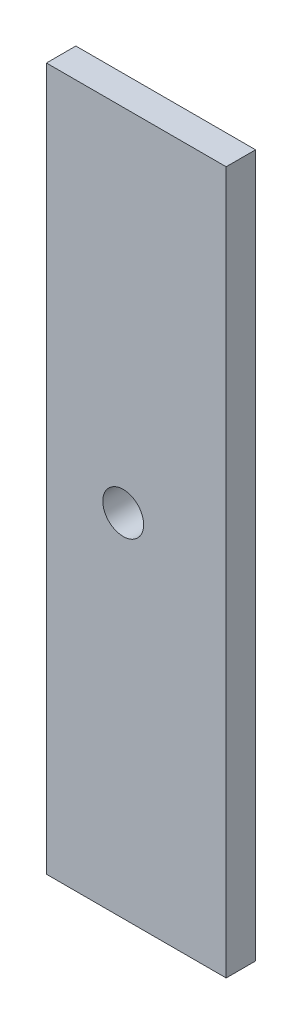
ISO-10303-21;
HEADER;
FILE_DESCRIPTION(('STEP AP214'),'2;1');
FILE_NAME('part.step','',(''),(''),'','','');
FILE_SCHEMA(('AUTOMOTIVE_DESIGN { 1 0 10303 214 1 1 1 1 }'));
ENDSEC;
DATA;
#1=APPLICATION_CONTEXT('core data for automotive mechanical design processes');
#2=APPLICATION_PROTOCOL_DEFINITION('international standard','automotive_design',2000,#1);
#3=PRODUCT_CONTEXT('',#1,'mechanical');
#4=PRODUCT('Part','Part','',(#3));
#5=PRODUCT_RELATED_PRODUCT_CATEGORY('part','',(#4));
#6=PRODUCT_DEFINITION_FORMATION('','',#4);
#7=PRODUCT_DEFINITION_CONTEXT('part definition',#1,'design');
#8=PRODUCT_DEFINITION('design','',#6,#7);
#9=PRODUCT_DEFINITION_SHAPE('','',#8);
#10=(LENGTH_UNIT() NAMED_UNIT(*) SI_UNIT(.MILLI.,.METRE.));
#11=(NAMED_UNIT(*) PLANE_ANGLE_UNIT() SI_UNIT($,.RADIAN.));
#12=(NAMED_UNIT(*) SI_UNIT($,.STERADIAN.) SOLID_ANGLE_UNIT());
#13=UNCERTAINTY_MEASURE_WITH_UNIT(LENGTH_MEASURE(1.E-05),#10,'distance_accuracy_value','');
#14=(GEOMETRIC_REPRESENTATION_CONTEXT(3) GLOBAL_UNCERTAINTY_ASSIGNED_CONTEXT((#13)) GLOBAL_UNIT_ASSIGNED_CONTEXT((#10,
#11,#12)) REPRESENTATION_CONTEXT('',''));
#15=CARTESIAN_POINT('',(0.,0.,0.));
#16=DIRECTION('',(0.,0.,1.));
#17=DIRECTION('',(1.,0.,0.));
#18=AXIS2_PLACEMENT_3D('',#15,#16,#17);
#19=CARTESIAN_POINT('',(0.,0.,18.));
#20=DIRECTION('',(0.,0.,1.));
#21=DIRECTION('',(1.,0.,0.));
#22=AXIS2_PLACEMENT_3D('',#19,#20,#21);
#23=PLANE('',#22);
#24=DIRECTION('',(0.,1.,0.));
#25=VECTOR('',#24,1.);
#26=CARTESIAN_POINT('',(55.,215.,18.));
#27=LINE('',#26,#25);
#28=CARTESIAN_POINT('',(55.,-215.,18.));
#29=VERTEX_POINT('',#28);
#30=CARTESIAN_POINT('',(55.,215.,18.));
#31=VERTEX_POINT('',#30);
#32=EDGE_CURVE('E85',#29,#31,#27,.T.);
#33=ORIENTED_EDGE('',*,*,#32,.T.);
#34=DIRECTION('',(-1.,0.,0.));
#35=VECTOR('',#34,1.);
#36=CARTESIAN_POINT('',(-55.,215.,18.));
#37=LINE('',#36,#35);
#38=CARTESIAN_POINT('',(-55.,215.,18.));
#39=VERTEX_POINT('',#38);
#40=EDGE_CURVE('E80',#31,#39,#37,.T.);
#41=ORIENTED_EDGE('',*,*,#40,.T.);
#42=DIRECTION('',(0.,-1.,0.));
#43=VECTOR('',#42,1.);
#44=CARTESIAN_POINT('',(-55.,215.,18.));
#45=LINE('',#44,#43);
#46=CARTESIAN_POINT('',(-55.,-215.,18.));
#47=VERTEX_POINT('',#46);
#48=EDGE_CURVE('E83',#39,#47,#45,.T.);
#49=ORIENTED_EDGE('',*,*,#48,.T.);
#50=DIRECTION('',(1.,0.,0.));
#51=VECTOR('',#50,1.);
#52=CARTESIAN_POINT('',(-55.,-215.,18.));
#53=LINE('',#52,#51);
#54=EDGE_CURVE('E50',#47,#29,#53,.T.);
#55=ORIENTED_EDGE('',*,*,#54,.T.);
#56=EDGE_LOOP('',(#33,#41,#49,#55));
#57=FACE_BOUND('',#56,.T.);
#58=CARTESIAN_POINT('',(-8.,0.,18.));
#59=DIRECTION('',(0.,0.,1.));
#60=DIRECTION('',(1.,0.,0.));
#61=AXIS2_PLACEMENT_3D('',#58,#59,#60);
#62=CIRCLE('',#61,12.5);
#63=CARTESIAN_POINT('',(4.5,0.,18.));
#64=VERTEX_POINT('',#63);
#65=EDGE_CURVE('E100',#64,#64,#62,.T.);
#66=ORIENTED_EDGE('',*,*,#65,.F.);
#67=EDGE_LOOP('',(#66));
#68=FACE_BOUND('',#67,.T.);
#69=ADVANCED_FACE('F33',(#57,#68),#23,.T.);
#70=CARTESIAN_POINT('',(0.,0.,0.));
#71=DIRECTION('',(0.,0.,1.));
#72=DIRECTION('',(1.,0.,0.));
#73=AXIS2_PLACEMENT_3D('',#70,#71,#72);
#74=PLANE('',#73);
#75=DIRECTION('',(0.,1.,0.));
#76=VECTOR('',#75,1.);
#77=CARTESIAN_POINT('',(55.,215.,0.));
#78=LINE('',#77,#76);
#79=CARTESIAN_POINT('',(55.,-215.,0.));
#80=VERTEX_POINT('',#79);
#81=CARTESIAN_POINT('',(55.,215.,0.));
#82=VERTEX_POINT('',#81);
#83=EDGE_CURVE('E97',#80,#82,#78,.T.);
#84=ORIENTED_EDGE('',*,*,#83,.F.);
#85=DIRECTION('',(1.,0.,0.));
#86=VECTOR('',#85,1.);
#87=CARTESIAN_POINT('',(-55.,-215.,0.));
#88=LINE('',#87,#86);
#89=CARTESIAN_POINT('',(-55.,-215.,0.));
#90=VERTEX_POINT('',#89);
#91=EDGE_CURVE('E73',#90,#80,#88,.T.);
#92=ORIENTED_EDGE('',*,*,#91,.F.);
#93=DIRECTION('',(0.,-1.,0.));
#94=VECTOR('',#93,1.);
#95=CARTESIAN_POINT('',(-55.,215.,0.));
#96=LINE('',#95,#94);
#97=CARTESIAN_POINT('',(-55.,215.,0.));
#98=VERTEX_POINT('',#97);
#99=EDGE_CURVE('E67',#98,#90,#96,.T.);
#100=ORIENTED_EDGE('',*,*,#99,.F.);
#101=DIRECTION('',(-1.,0.,0.));
#102=VECTOR('',#101,1.);
#103=CARTESIAN_POINT('',(-55.,215.,0.));
#104=LINE('',#103,#102);
#105=EDGE_CURVE('E89',#82,#98,#104,.T.);
#106=ORIENTED_EDGE('',*,*,#105,.F.);
#107=EDGE_LOOP('',(#84,#92,#100,#106));
#108=FACE_BOUND('',#107,.T.);
#109=CARTESIAN_POINT('',(-8.,0.,0.));
#110=DIRECTION('',(0.,0.,1.));
#111=DIRECTION('',(1.,0.,0.));
#112=AXIS2_PLACEMENT_3D('',#109,#110,#111);
#113=CIRCLE('',#112,12.5);
#114=CARTESIAN_POINT('',(4.5,0.,0.));
#115=VERTEX_POINT('',#114);
#116=EDGE_CURVE('E112',#115,#115,#113,.T.);
#117=ORIENTED_EDGE('',*,*,#116,.T.);
#118=EDGE_LOOP('',(#117));
#119=FACE_BOUND('',#118,.T.);
#120=ADVANCED_FACE('F108',(#108,#119),#74,.F.);
#121=CARTESIAN_POINT('',(55.,215.,18.));
#122=DIRECTION('',(-1.,0.,0.));
#123=DIRECTION('',(0.,-1.,0.));
#124=AXIS2_PLACEMENT_3D('',#121,#122,#123);
#125=PLANE('',#124);
#126=ORIENTED_EDGE('',*,*,#83,.T.);
#127=DIRECTION('',(0.,0.,-1.));
#128=VECTOR('',#127,1.);
#129=CARTESIAN_POINT('',(55.,215.,18.));
#130=LINE('',#129,#128);
#131=EDGE_CURVE('E11',#31,#82,#130,.T.);
#132=ORIENTED_EDGE('',*,*,#131,.F.);
#133=ORIENTED_EDGE('',*,*,#32,.F.);
#134=DIRECTION('',(0.,0.,-1.));
#135=VECTOR('',#134,1.);
#136=CARTESIAN_POINT('',(55.,-215.,18.));
#137=LINE('',#136,#135);
#138=EDGE_CURVE('E93',#29,#80,#137,.T.);
#139=ORIENTED_EDGE('',*,*,#138,.T.);
#140=EDGE_LOOP('',(#126,#132,#133,#139));
#141=FACE_BOUND('',#140,.T.);
#142=ADVANCED_FACE('F35',(#141),#125,.F.);
#143=CARTESIAN_POINT('',(-55.,215.,18.));
#144=DIRECTION('',(0.,-1.,0.));
#145=DIRECTION('',(0.,0.,-1.));
#146=AXIS2_PLACEMENT_3D('',#143,#144,#145);
#147=PLANE('',#146);
#148=ORIENTED_EDGE('',*,*,#105,.T.);
#149=DIRECTION('',(0.,0.,-1.));
#150=VECTOR('',#149,1.);
#151=CARTESIAN_POINT('',(-55.,215.,18.));
#152=LINE('',#151,#150);
#153=EDGE_CURVE('E42',#39,#98,#152,.T.);
#154=ORIENTED_EDGE('',*,*,#153,.F.);
#155=ORIENTED_EDGE('',*,*,#40,.F.);
#156=ORIENTED_EDGE('',*,*,#131,.T.);
#157=EDGE_LOOP('',(#148,#154,#155,#156));
#158=FACE_BOUND('',#157,.T.);
#159=ADVANCED_FACE('F88',(#158),#147,.F.);
#160=CARTESIAN_POINT('',(-55.,215.,18.));
#161=DIRECTION('',(1.,0.,0.));
#162=DIRECTION('',(0.,1.,0.));
#163=AXIS2_PLACEMENT_3D('',#160,#161,#162);
#164=PLANE('',#163);
#165=ORIENTED_EDGE('',*,*,#99,.T.);
#166=DIRECTION('',(0.,0.,-1.));
#167=VECTOR('',#166,1.);
#168=CARTESIAN_POINT('',(-55.,-215.,18.));
#169=LINE('',#168,#167);
#170=EDGE_CURVE('E90',#47,#90,#169,.T.);
#171=ORIENTED_EDGE('',*,*,#170,.F.);
#172=ORIENTED_EDGE('',*,*,#48,.F.);
#173=ORIENTED_EDGE('',*,*,#153,.T.);
#174=EDGE_LOOP('',(#165,#171,#172,#173));
#175=FACE_BOUND('',#174,.T.);
#176=ADVANCED_FACE('F91',(#175),#164,.F.);
#177=CARTESIAN_POINT('',(-55.,-215.,18.));
#178=DIRECTION('',(0.,1.,0.));
#179=DIRECTION('',(0.,0.,1.));
#180=AXIS2_PLACEMENT_3D('',#177,#178,#179);
#181=PLANE('',#180);
#182=ORIENTED_EDGE('',*,*,#91,.T.);
#183=ORIENTED_EDGE('',*,*,#138,.F.);
#184=ORIENTED_EDGE('',*,*,#54,.F.);
#185=ORIENTED_EDGE('',*,*,#170,.T.);
#186=EDGE_LOOP('',(#182,#183,#184,#185));
#187=FACE_BOUND('',#186,.T.);
#188=ADVANCED_FACE('F105',(#187),#181,.F.);
#189=CARTESIAN_POINT('',(-8.,0.,18.));
#190=DIRECTION('',(0.,0.,-1.));
#191=DIRECTION('',(-1.,0.,0.));
#192=AXIS2_PLACEMENT_3D('',#189,#190,#191);
#193=CYLINDRICAL_SURFACE('',#192,12.5);
#194=ORIENTED_EDGE('',*,*,#65,.T.);
#195=EDGE_LOOP('',(#194));
#196=FACE_BOUND('',#195,.T.);
#197=ORIENTED_EDGE('',*,*,#116,.F.);
#198=EDGE_LOOP('',(#197));
#199=FACE_BOUND('',#198,.T.);
#200=ADVANCED_FACE('F118',(#196,#199),#193,.F.);
#201=CLOSED_SHELL('',(#69,#120,#142,#159,#176,#188,#200));
#202=MANIFOLD_SOLID_BREP('B2',#201);
#203=ADVANCED_BREP_SHAPE_REPRESENTATION('',(#18,#202),#14);
#204=SHAPE_DEFINITION_REPRESENTATION(#9,#203);
ENDSEC;
END-ISO-10303-21;
